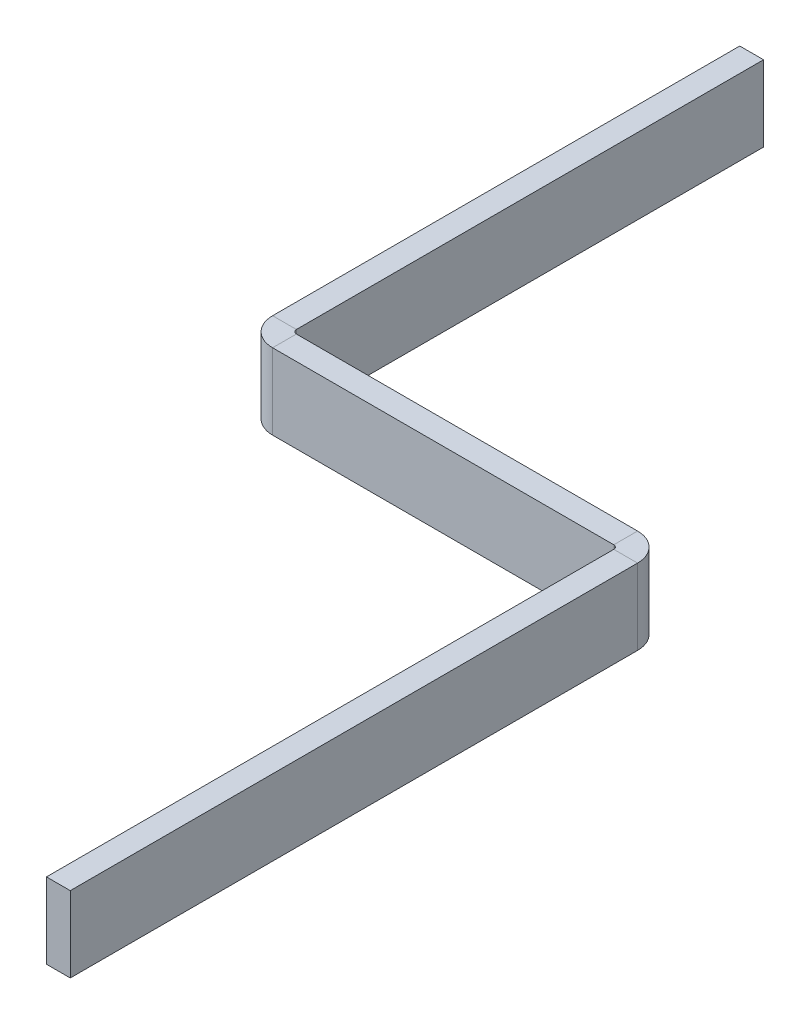
ISO-10303-21;
HEADER;
FILE_DESCRIPTION(('STEP AP214'),'2;1');
FILE_NAME('part.step','',(''),(''),'','','');
FILE_SCHEMA(('AUTOMOTIVE_DESIGN { 1 0 10303 214 1 1 1 1 }'));
ENDSEC;
DATA;
#1=APPLICATION_CONTEXT('core data for automotive mechanical design processes');
#2=APPLICATION_PROTOCOL_DEFINITION('international standard','automotive_design',2000,#1);
#3=PRODUCT_CONTEXT('',#1,'mechanical');
#4=PRODUCT('Part','Part','',(#3));
#5=PRODUCT_RELATED_PRODUCT_CATEGORY('part','',(#4));
#6=PRODUCT_DEFINITION_FORMATION('','',#4);
#7=PRODUCT_DEFINITION_CONTEXT('part definition',#1,'design');
#8=PRODUCT_DEFINITION('design','',#6,#7);
#9=PRODUCT_DEFINITION_SHAPE('','',#8);
#10=(LENGTH_UNIT() NAMED_UNIT(*) SI_UNIT(.MILLI.,.METRE.));
#11=(NAMED_UNIT(*) PLANE_ANGLE_UNIT() SI_UNIT($,.RADIAN.));
#12=(NAMED_UNIT(*) SI_UNIT($,.STERADIAN.) SOLID_ANGLE_UNIT());
#13=UNCERTAINTY_MEASURE_WITH_UNIT(LENGTH_MEASURE(1.E-05),#10,'distance_accuracy_value','');
#14=(GEOMETRIC_REPRESENTATION_CONTEXT(3) GLOBAL_UNCERTAINTY_ASSIGNED_CONTEXT((#13)) GLOBAL_UNIT_ASSIGNED_CONTEXT((#10,
#11,#12)) REPRESENTATION_CONTEXT('',''));
#15=CARTESIAN_POINT('',(0.,0.,0.));
#16=DIRECTION('',(0.,0.,1.));
#17=DIRECTION('',(1.,0.,0.));
#18=AXIS2_PLACEMENT_3D('',#15,#16,#17);
#19=CARTESIAN_POINT('',(94.,-9.53505874833614,62.3751759786992));
#20=DIRECTION('',(0.,1.,0.));
#21=DIRECTION('',(0.,0.,1.));
#22=AXIS2_PLACEMENT_3D('',#19,#20,#21);
#23=PLANE('',#22);
#24=DIRECTION('',(0.,0.,-1.));
#25=VECTOR('',#24,1.);
#26=CARTESIAN_POINT('',(87.,-9.53505874833614,62.3751759786992));
#27=LINE('',#26,#25);
#28=CARTESIAN_POINT('',(87.,-9.53505874833614,62.3751759786992));
#29=VERTEX_POINT('',#28);
#30=CARTESIAN_POINT('',(87.,-9.53505874833614,56.3751759786991));
#31=VERTEX_POINT('',#30);
#32=EDGE_CURVE('E222',#29,#31,#27,.T.);
#33=ORIENTED_EDGE('',*,*,#32,.F.);
#34=DIRECTION('',(1.,0.,0.));
#35=VECTOR('',#34,1.);
#36=CARTESIAN_POINT('',(-2.37356252209926E-13,-9.53505874833614,62.3751759786989));
#37=LINE('',#36,#35);
#38=CARTESIAN_POINT('',(0.999999999999994,-9.53505874833614,62.3751759786989));
#39=VERTEX_POINT('',#38);
#40=EDGE_CURVE('E230',#39,#29,#37,.T.);
#41=ORIENTED_EDGE('',*,*,#40,.F.);
#42=DIRECTION('',(0.,0.,-1.));
#43=VECTOR('',#42,1.);
#44=CARTESIAN_POINT('',(0.999999999999994,-9.53505874833614,56.3751759786988));
#45=LINE('',#44,#43);
#46=CARTESIAN_POINT('',(0.99999999999999,-9.53505874833614,56.3751759786989));
#47=VERTEX_POINT('',#46);
#48=EDGE_CURVE('E240',#47,#39,#45,.F.);
#49=ORIENTED_EDGE('',*,*,#48,.F.);
#50=DIRECTION('',(-1.,0.,0.));
#51=VECTOR('',#50,1.);
#52=CARTESIAN_POINT('',(94.,-9.53505874833614,56.3751759786992));
#53=LINE('',#52,#51);
#54=EDGE_CURVE('E235',#47,#31,#53,.F.);
#55=ORIENTED_EDGE('',*,*,#54,.T.);
#56=EDGE_LOOP('',(#33,#41,#49,#55));
#57=FACE_BOUND('',#56,.T.);
#58=ADVANCED_FACE('F75',(#57),#23,.F.);
#59=CARTESIAN_POINT('',(0.,9.53505874833614,62.3751759786989));
#60=DIRECTION('',(0.,-1.,0.));
#61=DIRECTION('',(0.,0.,-1.));
#62=AXIS2_PLACEMENT_3D('',#59,#60,#61);
#63=PLANE('',#62);
#64=DIRECTION('',(0.,0.,-1.));
#65=VECTOR('',#64,1.);
#66=CARTESIAN_POINT('',(87.,9.53505874833614,62.3751759786992));
#67=LINE('',#66,#65);
#68=CARTESIAN_POINT('',(87.,9.53505874833614,62.3751759786992));
#69=VERTEX_POINT('',#68);
#70=CARTESIAN_POINT('',(87.,9.53505874833614,56.3751759786992));
#71=VERTEX_POINT('',#70);
#72=EDGE_CURVE('E211',#69,#71,#67,.T.);
#73=ORIENTED_EDGE('',*,*,#72,.T.);
#74=DIRECTION('',(1.,0.,0.));
#75=VECTOR('',#74,1.);
#76=CARTESIAN_POINT('',(0.,9.53505874833614,56.3751759786988));
#77=LINE('',#76,#75);
#78=CARTESIAN_POINT('',(0.99999999999999,9.53505874833614,56.3751759786989));
#79=VERTEX_POINT('',#78);
#80=EDGE_CURVE('E233',#71,#79,#77,.F.);
#81=ORIENTED_EDGE('',*,*,#80,.T.);
#82=DIRECTION('',(0.,0.,-1.));
#83=VECTOR('',#82,1.);
#84=CARTESIAN_POINT('',(0.999999999999994,9.53505874833614,62.3751759786989));
#85=LINE('',#84,#83);
#86=CARTESIAN_POINT('',(0.99999999999997,9.53505874833614,62.3751759786989));
#87=VERTEX_POINT('',#86);
#88=EDGE_CURVE('E224',#79,#87,#85,.F.);
#89=ORIENTED_EDGE('',*,*,#88,.T.);
#90=DIRECTION('',(-1.,0.,0.));
#91=VECTOR('',#90,1.);
#92=CARTESIAN_POINT('',(-2.37356252209926E-13,9.53505874833614,62.3751759786989));
#93=LINE('',#92,#91);
#94=EDGE_CURVE('E227',#69,#87,#93,.T.);
#95=ORIENTED_EDGE('',*,*,#94,.F.);
#96=EDGE_LOOP('',(#73,#81,#89,#95));
#97=FACE_BOUND('',#96,.T.);
#98=ADVANCED_FACE('F330',(#97),#63,.F.);
#99=CARTESIAN_POINT('',(-2.37356252209926E-13,0.,62.3751759786989));
#100=DIRECTION('',(0.,0.,-1.));
#101=DIRECTION('',(-1.,0.,0.));
#102=AXIS2_PLACEMENT_3D('',#99,#100,#101);
#103=PLANE('',#102);
#104=DIRECTION('',(0.,1.,0.));
#105=VECTOR('',#104,1.);
#106=CARTESIAN_POINT('',(87.,9.53505874833614,62.3751759786992));
#107=LINE('',#106,#105);
#108=EDGE_CURVE('E217',#69,#29,#107,.F.);
#109=ORIENTED_EDGE('',*,*,#108,.F.);
#110=ORIENTED_EDGE('',*,*,#94,.T.);
#111=DIRECTION('',(0.,-1.,0.));
#112=VECTOR('',#111,1.);
#113=CARTESIAN_POINT('',(0.999999999999994,9.53505874833614,62.3751759786989));
#114=LINE('',#113,#112);
#115=EDGE_CURVE('E238',#39,#87,#114,.F.);
#116=ORIENTED_EDGE('',*,*,#115,.F.);
#117=ORIENTED_EDGE('',*,*,#40,.T.);
#118=EDGE_LOOP('',(#109,#110,#116,#117));
#119=FACE_BOUND('',#118,.T.);
#120=ADVANCED_FACE('F314',(#119),#103,.F.);
#121=CARTESIAN_POINT('',(-2.16407364176867E-13,0.,56.3751759786988));
#122=DIRECTION('',(0.,0.,-1.));
#123=DIRECTION('',(-1.,0.,0.));
#124=AXIS2_PLACEMENT_3D('',#121,#122,#123);
#125=PLANE('',#124);
#126=ORIENTED_EDGE('',*,*,#80,.F.);
#127=DIRECTION('',(0.,1.,0.));
#128=VECTOR('',#127,1.);
#129=CARTESIAN_POINT('',(87.,9.53505874833614,56.3751759786992));
#130=LINE('',#129,#128);
#131=EDGE_CURVE('E206',#71,#31,#130,.F.);
#132=ORIENTED_EDGE('',*,*,#131,.T.);
#133=ORIENTED_EDGE('',*,*,#54,.F.);
#134=DIRECTION('',(0.,-1.,0.));
#135=VECTOR('',#134,1.);
#136=CARTESIAN_POINT('',(0.999999999999994,9.53505874833614,56.3751759786988));
#137=LINE('',#136,#135);
#138=EDGE_CURVE('E243',#79,#47,#137,.T.);
#139=ORIENTED_EDGE('',*,*,#138,.F.);
#140=EDGE_LOOP('',(#126,#132,#133,#139));
#141=FACE_BOUND('',#140,.T.);
#142=ADVANCED_FACE('F322',(#141),#125,.T.);
#143=CARTESIAN_POINT('',(-6.,-9.53505874833614,62.3751759786988));
#144=DIRECTION('',(0.,-1.,0.));
#145=DIRECTION('',(0.,0.,-1.));
#146=AXIS2_PLACEMENT_3D('',#143,#144,#145);
#147=PLANE('',#146);
#148=DIRECTION('',(0.,0.,-1.));
#149=VECTOR('',#148,1.);
#150=CARTESIAN_POINT('',(0.,-9.53505874833614,62.3751759786988));
#151=LINE('',#150,#149);
#152=CARTESIAN_POINT('',(0.,-9.53505874833614,55.3751759786989));
#153=VERTEX_POINT('',#152);
#154=CARTESIAN_POINT('',(0.,-9.53505874833614,-62.3751759786988));
#155=VERTEX_POINT('',#154);
#156=EDGE_CURVE('E271',#153,#155,#151,.T.);
#157=ORIENTED_EDGE('',*,*,#156,.F.);
#158=DIRECTION('',(-1.,0.,0.));
#159=VECTOR('',#158,1.);
#160=CARTESIAN_POINT('',(0.,-9.53505874833614,55.3751759786989));
#161=LINE('',#160,#159);
#162=CARTESIAN_POINT('',(-6.00000000000001,-9.53505874833614,55.3751759786989));
#163=VERTEX_POINT('',#162);
#164=EDGE_CURVE('E252',#153,#163,#161,.T.);
#165=ORIENTED_EDGE('',*,*,#164,.T.);
#166=DIRECTION('',(0.,0.,-1.));
#167=VECTOR('',#166,1.);
#168=CARTESIAN_POINT('',(-6.,-9.53505874833614,62.3751759786988));
#169=LINE('',#168,#167);
#170=CARTESIAN_POINT('',(-6.,-9.53505874833614,-62.3751759786988));
#171=VERTEX_POINT('',#170);
#172=EDGE_CURVE('E274',#163,#171,#169,.T.);
#173=ORIENTED_EDGE('',*,*,#172,.T.);
#174=DIRECTION('',(1.,0.,0.));
#175=VECTOR('',#174,1.);
#176=CARTESIAN_POINT('',(-6.,-9.53505874833614,-62.3751759786988));
#177=LINE('',#176,#175);
#178=EDGE_CURVE('E13',#171,#155,#177,.T.);
#179=ORIENTED_EDGE('',*,*,#178,.T.);
#180=EDGE_LOOP('',(#157,#165,#173,#179));
#181=FACE_BOUND('',#180,.T.);
#182=ADVANCED_FACE('F288',(#181),#147,.T.);
#183=CARTESIAN_POINT('',(-6.,0.,0.));
#184=DIRECTION('',(-1.,0.,0.));
#185=DIRECTION('',(0.,0.,1.));
#186=AXIS2_PLACEMENT_3D('',#183,#184,#185);
#187=PLANE('',#186);
#188=ORIENTED_EDGE('',*,*,#172,.F.);
#189=DIRECTION('',(0.,-1.,0.));
#190=VECTOR('',#189,1.);
#191=CARTESIAN_POINT('',(-6.00000000000001,-9.53505874833614,55.3751759786989));
#192=LINE('',#191,#190);
#193=CARTESIAN_POINT('',(-6.,9.53505874833614,55.3751759786989));
#194=VERTEX_POINT('',#193);
#195=EDGE_CURVE('E247',#163,#194,#192,.F.);
#196=ORIENTED_EDGE('',*,*,#195,.T.);
#197=DIRECTION('',(0.,0.,1.));
#198=VECTOR('',#197,1.);
#199=CARTESIAN_POINT('',(-6.,9.53505874833614,62.3751759786988));
#200=LINE('',#199,#198);
#201=CARTESIAN_POINT('',(-6.,9.53505874833614,-62.3751759786988));
#202=VERTEX_POINT('',#201);
#203=EDGE_CURVE('E270',#202,#194,#200,.T.);
#204=ORIENTED_EDGE('',*,*,#203,.F.);
#205=DIRECTION('',(0.,1.,0.));
#206=VECTOR('',#205,1.);
#207=CARTESIAN_POINT('',(-6.,-9.53505874833614,-62.3751759786988));
#208=LINE('',#207,#206);
#209=EDGE_CURVE('E267',#171,#202,#208,.T.);
#210=ORIENTED_EDGE('',*,*,#209,.F.);
#211=EDGE_LOOP('',(#188,#196,#204,#210));
#212=FACE_BOUND('',#211,.T.);
#213=ADVANCED_FACE('F302',(#212),#187,.T.);
#214=CARTESIAN_POINT('',(0.,0.,0.));
#215=DIRECTION('',(-1.,0.,0.));
#216=DIRECTION('',(0.,0.,1.));
#217=AXIS2_PLACEMENT_3D('',#214,#215,#216);
#218=PLANE('',#217);
#219=DIRECTION('',(0.,-1.,0.));
#220=VECTOR('',#219,1.);
#221=CARTESIAN_POINT('',(0.,-9.53505874833614,55.3751759786989));
#222=LINE('',#221,#220);
#223=CARTESIAN_POINT('',(0.,9.53505874833614,55.3751759786989));
#224=VERTEX_POINT('',#223);
#225=EDGE_CURVE('E258',#153,#224,#222,.F.);
#226=ORIENTED_EDGE('',*,*,#225,.F.);
#227=ORIENTED_EDGE('',*,*,#156,.T.);
#228=DIRECTION('',(0.,1.,0.));
#229=VECTOR('',#228,1.);
#230=CARTESIAN_POINT('',(0.,-9.53505874833614,-62.3751759786988));
#231=LINE('',#230,#229);
#232=CARTESIAN_POINT('',(0.,9.53505874833614,-62.3751759786988));
#233=VERTEX_POINT('',#232);
#234=EDGE_CURVE('E264',#155,#233,#231,.T.);
#235=ORIENTED_EDGE('',*,*,#234,.T.);
#236=DIRECTION('',(0.,0.,1.));
#237=VECTOR('',#236,1.);
#238=CARTESIAN_POINT('',(0.,9.53505874833614,62.3751759786988));
#239=LINE('',#238,#237);
#240=EDGE_CURVE('E278',#233,#224,#239,.T.);
#241=ORIENTED_EDGE('',*,*,#240,.T.);
#242=EDGE_LOOP('',(#226,#227,#235,#241));
#243=FACE_BOUND('',#242,.T.);
#244=ADVANCED_FACE('F284',(#243),#218,.F.);
#245=CARTESIAN_POINT('',(-6.,-9.53505874833614,-62.3751759786988));
#246=DIRECTION('',(0.,0.,-1.));
#247=DIRECTION('',(-1.,0.,0.));
#248=AXIS2_PLACEMENT_3D('',#245,#246,#247);
#249=PLANE('',#248);
#250=ORIENTED_EDGE('',*,*,#234,.F.);
#251=ORIENTED_EDGE('',*,*,#178,.F.);
#252=ORIENTED_EDGE('',*,*,#209,.T.);
#253=DIRECTION('',(1.,0.,0.));
#254=VECTOR('',#253,1.);
#255=CARTESIAN_POINT('',(-6.,9.53505874833614,-62.3751759786988));
#256=LINE('',#255,#254);
#257=EDGE_CURVE('E79',#202,#233,#256,.T.);
#258=ORIENTED_EDGE('',*,*,#257,.T.);
#259=EDGE_LOOP('',(#250,#251,#252,#258));
#260=FACE_BOUND('',#259,.T.);
#261=ADVANCED_FACE('F77',(#260),#249,.T.);
#262=CARTESIAN_POINT('',(-6.,9.53505874833614,62.3751759786988));
#263=DIRECTION('',(0.,1.,0.));
#264=DIRECTION('',(0.,0.,1.));
#265=AXIS2_PLACEMENT_3D('',#262,#263,#264);
#266=PLANE('',#265);
#267=DIRECTION('',(-1.,0.,0.));
#268=VECTOR('',#267,1.);
#269=CARTESIAN_POINT('',(0.,9.53505874833614,55.3751759786989));
#270=LINE('',#269,#268);
#271=EDGE_CURVE('E262',#224,#194,#270,.T.);
#272=ORIENTED_EDGE('',*,*,#271,.F.);
#273=ORIENTED_EDGE('',*,*,#240,.F.);
#274=ORIENTED_EDGE('',*,*,#257,.F.);
#275=ORIENTED_EDGE('',*,*,#203,.T.);
#276=EDGE_LOOP('',(#272,#273,#274,#275));
#277=FACE_BOUND('',#276,.T.);
#278=ADVANCED_FACE('F296',(#277),#266,.T.);
#279=CARTESIAN_POINT('',(0.999999999999994,9.53505874833614,55.3751759786989));
#280=DIRECTION('',(0.,1.,0.));
#281=DIRECTION('',(0.,0.,1.));
#282=AXIS2_PLACEMENT_3D('',#279,#280,#281);
#283=PLANE('',#282);
#284=ORIENTED_EDGE('',*,*,#88,.F.);
#285=CARTESIAN_POINT('',(0.999999999999994,9.53505874833614,55.3751759786989));
#286=DIRECTION('',(0.,-1.,0.));
#287=DIRECTION('',(0.,0.,-1.));
#288=AXIS2_PLACEMENT_3D('',#285,#286,#287);
#289=CIRCLE('',#288,1.);
#290=EDGE_CURVE('E255',#224,#79,#289,.F.);
#291=ORIENTED_EDGE('',*,*,#290,.F.);
#292=ORIENTED_EDGE('',*,*,#271,.T.);
#293=CARTESIAN_POINT('',(0.999999999999994,9.53505874833614,55.3751759786989));
#294=DIRECTION('',(0.,-1.,0.));
#295=DIRECTION('',(0.,0.,-1.));
#296=AXIS2_PLACEMENT_3D('',#293,#294,#295);
#297=CIRCLE('',#296,7.);
#298=EDGE_CURVE('E98',#194,#87,#297,.F.);
#299=ORIENTED_EDGE('',*,*,#298,.T.);
#300=EDGE_LOOP('',(#284,#291,#292,#299));
#301=FACE_BOUND('',#300,.T.);
#302=ADVANCED_FACE('F300',(#301),#283,.T.);
#303=CARTESIAN_POINT('',(0.999999999999994,-9.53505874833614,55.3751759786989));
#304=DIRECTION('',(0.,1.,0.));
#305=DIRECTION('',(0.,0.,1.));
#306=AXIS2_PLACEMENT_3D('',#303,#304,#305);
#307=PLANE('',#306);
#308=CARTESIAN_POINT('',(0.999999999999994,-9.53505874833614,55.3751759786989));
#309=DIRECTION('',(0.,-1.,0.));
#310=DIRECTION('',(0.,0.,-1.));
#311=AXIS2_PLACEMENT_3D('',#308,#309,#310);
#312=CIRCLE('',#311,1.);
#313=EDGE_CURVE('E229',#47,#153,#312,.T.);
#314=ORIENTED_EDGE('',*,*,#313,.F.);
#315=ORIENTED_EDGE('',*,*,#48,.T.);
#316=CARTESIAN_POINT('',(0.999999999999994,-9.53505874833614,55.3751759786989));
#317=DIRECTION('',(0.,-1.,0.));
#318=DIRECTION('',(0.,0.,-1.));
#319=AXIS2_PLACEMENT_3D('',#316,#317,#318);
#320=CIRCLE('',#319,7.);
#321=EDGE_CURVE('E250',#39,#163,#320,.T.);
#322=ORIENTED_EDGE('',*,*,#321,.T.);
#323=ORIENTED_EDGE('',*,*,#164,.F.);
#324=EDGE_LOOP('',(#314,#315,#322,#323));
#325=FACE_BOUND('',#324,.T.);
#326=ADVANCED_FACE('F306',(#325),#307,.F.);
#327=CARTESIAN_POINT('',(0.999999999999994,-9.53505874833614,55.3751759786989));
#328=DIRECTION('',(0.,-1.,0.));
#329=DIRECTION('',(0.,0.,1.));
#330=AXIS2_PLACEMENT_3D('',#327,#328,#329);
#331=CYLINDRICAL_SURFACE('',#330,7.);
#332=ORIENTED_EDGE('',*,*,#195,.F.);
#333=ORIENTED_EDGE('',*,*,#321,.F.);
#334=ORIENTED_EDGE('',*,*,#115,.T.);
#335=ORIENTED_EDGE('',*,*,#298,.F.);
#336=EDGE_LOOP('',(#332,#333,#334,#335));
#337=FACE_BOUND('',#336,.T.);
#338=ADVANCED_FACE('F303',(#337),#331,.T.);
#339=CARTESIAN_POINT('',(0.999999999999994,-9.53505874833614,55.3751759786989));
#340=DIRECTION('',(0.,-1.,0.));
#341=DIRECTION('',(0.,0.,1.));
#342=AXIS2_PLACEMENT_3D('',#339,#340,#341);
#343=CYLINDRICAL_SURFACE('',#342,1.);
#344=ORIENTED_EDGE('',*,*,#225,.T.);
#345=ORIENTED_EDGE('',*,*,#290,.T.);
#346=ORIENTED_EDGE('',*,*,#138,.T.);
#347=ORIENTED_EDGE('',*,*,#313,.T.);
#348=EDGE_LOOP('',(#344,#345,#346,#347));
#349=FACE_BOUND('',#348,.T.);
#350=ADVANCED_FACE('F332',(#349),#343,.F.);
#351=CARTESIAN_POINT('',(87.,-9.53505874833614,63.3751759786992));
#352=DIRECTION('',(0.,-1.,0.));
#353=DIRECTION('',(0.,0.,-1.));
#354=AXIS2_PLACEMENT_3D('',#351,#352,#353);
#355=PLANE('',#354);
#356=DIRECTION('',(-1.,0.,0.));
#357=VECTOR('',#356,1.);
#358=CARTESIAN_POINT('',(94.,-9.53505874833614,63.3751759786992));
#359=LINE('',#358,#357);
#360=CARTESIAN_POINT('',(88.,-9.53505874833614,63.3751759786992));
#361=VERTEX_POINT('',#360);
#362=CARTESIAN_POINT('',(94.,-9.53505874833614,63.3751759786992));
#363=VERTEX_POINT('',#362);
#364=EDGE_CURVE('E189',#361,#363,#359,.F.);
#365=ORIENTED_EDGE('',*,*,#364,.F.);
#366=CARTESIAN_POINT('',(87.,-9.53505874833614,63.3751759786992));
#367=DIRECTION('',(0.,1.,0.));
#368=DIRECTION('',(0.,0.,1.));
#369=AXIS2_PLACEMENT_3D('',#366,#367,#368);
#370=CIRCLE('',#369,1.);
#371=EDGE_CURVE('E214',#29,#361,#370,.F.);
#372=ORIENTED_EDGE('',*,*,#371,.F.);
#373=ORIENTED_EDGE('',*,*,#32,.T.);
#374=CARTESIAN_POINT('',(87.,-9.53505874833614,63.3751759786992));
#375=DIRECTION('',(0.,1.,0.));
#376=DIRECTION('',(0.,0.,1.));
#377=AXIS2_PLACEMENT_3D('',#374,#375,#376);
#378=CIRCLE('',#377,7.);
#379=EDGE_CURVE('E90',#31,#363,#378,.F.);
#380=ORIENTED_EDGE('',*,*,#379,.T.);
#381=EDGE_LOOP('',(#365,#372,#373,#380));
#382=FACE_BOUND('',#381,.T.);
#383=ADVANCED_FACE('F319',(#382),#355,.T.);
#384=CARTESIAN_POINT('',(87.,9.53505874833614,63.3751759786992));
#385=DIRECTION('',(0.,-1.,0.));
#386=DIRECTION('',(0.,0.,-1.));
#387=AXIS2_PLACEMENT_3D('',#384,#385,#386);
#388=PLANE('',#387);
#389=CARTESIAN_POINT('',(87.,9.53505874833614,63.3751759786992));
#390=DIRECTION('',(0.,1.,0.));
#391=DIRECTION('',(0.,0.,1.));
#392=AXIS2_PLACEMENT_3D('',#389,#390,#391);
#393=CIRCLE('',#392,1.);
#394=CARTESIAN_POINT('',(88.,9.53505874833614,63.3751759786992));
#395=VERTEX_POINT('',#394);
#396=EDGE_CURVE('E219',#395,#69,#393,.T.);
#397=ORIENTED_EDGE('',*,*,#396,.F.);
#398=DIRECTION('',(-1.,0.,0.));
#399=VECTOR('',#398,1.);
#400=CARTESIAN_POINT('',(88.,9.53505874833614,63.3751759786992));
#401=LINE('',#400,#399);
#402=CARTESIAN_POINT('',(94.,9.53505874833614,63.3751759786992));
#403=VERTEX_POINT('',#402);
#404=EDGE_CURVE('E200',#395,#403,#401,.F.);
#405=ORIENTED_EDGE('',*,*,#404,.T.);
#406=CARTESIAN_POINT('',(87.,9.53505874833614,63.3751759786992));
#407=DIRECTION('',(0.,1.,0.));
#408=DIRECTION('',(0.,0.,1.));
#409=AXIS2_PLACEMENT_3D('',#406,#407,#408);
#410=CIRCLE('',#409,7.);
#411=EDGE_CURVE('E209',#403,#71,#410,.T.);
#412=ORIENTED_EDGE('',*,*,#411,.T.);
#413=ORIENTED_EDGE('',*,*,#72,.F.);
#414=EDGE_LOOP('',(#397,#405,#412,#413));
#415=FACE_BOUND('',#414,.T.);
#416=ADVANCED_FACE('F327',(#415),#388,.F.);
#417=CARTESIAN_POINT('',(87.,9.53505874833614,63.3751759786992));
#418=DIRECTION('',(0.,1.,0.));
#419=DIRECTION('',(1.,0.,0.));
#420=AXIS2_PLACEMENT_3D('',#417,#418,#419);
#421=CYLINDRICAL_SURFACE('',#420,7.);
#422=ORIENTED_EDGE('',*,*,#131,.F.);
#423=ORIENTED_EDGE('',*,*,#411,.F.);
#424=DIRECTION('',(0.,1.,0.));
#425=VECTOR('',#424,1.);
#426=CARTESIAN_POINT('',(94.,-9.53505874833614,63.3751759786992));
#427=LINE('',#426,#425);
#428=EDGE_CURVE('E198',#403,#363,#427,.F.);
#429=ORIENTED_EDGE('',*,*,#428,.T.);
#430=ORIENTED_EDGE('',*,*,#379,.F.);
#431=EDGE_LOOP('',(#422,#423,#429,#430));
#432=FACE_BOUND('',#431,.T.);
#433=ADVANCED_FACE('F324',(#432),#421,.T.);
#434=CARTESIAN_POINT('',(87.,9.53505874833614,63.3751759786992));
#435=DIRECTION('',(0.,1.,0.));
#436=DIRECTION('',(1.,0.,0.));
#437=AXIS2_PLACEMENT_3D('',#434,#435,#436);
#438=CYLINDRICAL_SURFACE('',#437,1.);
#439=ORIENTED_EDGE('',*,*,#108,.T.);
#440=ORIENTED_EDGE('',*,*,#371,.T.);
#441=DIRECTION('',(0.,1.,0.));
#442=VECTOR('',#441,1.);
#443=CARTESIAN_POINT('',(88.,-9.53505874833614,63.3751759786992));
#444=LINE('',#443,#442);
#445=EDGE_CURVE('E203',#361,#395,#444,.T.);
#446=ORIENTED_EDGE('',*,*,#445,.T.);
#447=ORIENTED_EDGE('',*,*,#396,.T.);
#448=EDGE_LOOP('',(#439,#440,#446,#447));
#449=FACE_BOUND('',#448,.T.);
#450=ADVANCED_FACE('F355',(#449),#438,.F.);
#451=CARTESIAN_POINT('',(94.,-9.53505874833614,62.3751759786992));
#452=DIRECTION('',(0.,1.,0.));
#453=DIRECTION('',(0.,0.,1.));
#454=AXIS2_PLACEMENT_3D('',#451,#452,#453);
#455=PLANE('',#454);
#456=ORIENTED_EDGE('',*,*,#364,.T.);
#457=DIRECTION('',(0.,0.,-1.));
#458=VECTOR('',#457,1.);
#459=CARTESIAN_POINT('',(94.,-9.53505874833614,0.));
#460=LINE('',#459,#458);
#461=CARTESIAN_POINT('',(94.,-9.53505874833614,206.375175978699));
#462=VERTEX_POINT('',#461);
#463=EDGE_CURVE('E170',#462,#363,#460,.T.);
#464=ORIENTED_EDGE('',*,*,#463,.F.);
#465=DIRECTION('',(-1.,0.,0.));
#466=VECTOR('',#465,1.);
#467=CARTESIAN_POINT('',(94.,-9.53505874833614,206.375175978699));
#468=LINE('',#467,#466);
#469=CARTESIAN_POINT('',(88.,-9.53505874833614,206.375175978699));
#470=VERTEX_POINT('',#469);
#471=EDGE_CURVE('E176',#462,#470,#468,.T.);
#472=ORIENTED_EDGE('',*,*,#471,.T.);
#473=DIRECTION('',(0.,0.,1.));
#474=VECTOR('',#473,1.);
#475=CARTESIAN_POINT('',(88.,-9.53505874833614,62.3751759786992));
#476=LINE('',#475,#474);
#477=EDGE_CURVE('E196',#470,#361,#476,.F.);
#478=ORIENTED_EDGE('',*,*,#477,.T.);
#479=EDGE_LOOP('',(#456,#464,#472,#478));
#480=FACE_BOUND('',#479,.T.);
#481=ADVANCED_FACE('F188',(#480),#455,.F.);
#482=CARTESIAN_POINT('',(94.,9.53505874833614,206.375175978699));
#483=DIRECTION('',(0.,-1.,0.));
#484=DIRECTION('',(0.,0.,-1.));
#485=AXIS2_PLACEMENT_3D('',#482,#483,#484);
#486=PLANE('',#485);
#487=ORIENTED_EDGE('',*,*,#404,.F.);
#488=DIRECTION('',(0.,0.,-1.));
#489=VECTOR('',#488,1.);
#490=CARTESIAN_POINT('',(88.,9.53505874833614,206.375175978699));
#491=LINE('',#490,#489);
#492=CARTESIAN_POINT('',(88.,9.53505874833614,206.375175978699));
#493=VERTEX_POINT('',#492);
#494=EDGE_CURVE('E192',#395,#493,#491,.F.);
#495=ORIENTED_EDGE('',*,*,#494,.T.);
#496=DIRECTION('',(-1.,0.,0.));
#497=VECTOR('',#496,1.);
#498=CARTESIAN_POINT('',(94.,9.53505874833614,206.375175978699));
#499=LINE('',#498,#497);
#500=CARTESIAN_POINT('',(94.,9.53505874833614,206.375175978699));
#501=VERTEX_POINT('',#500);
#502=EDGE_CURVE('E185',#501,#493,#499,.T.);
#503=ORIENTED_EDGE('',*,*,#502,.F.);
#504=DIRECTION('',(0.,0.,1.));
#505=VECTOR('',#504,1.);
#506=CARTESIAN_POINT('',(94.,9.53505874833614,0.));
#507=LINE('',#506,#505);
#508=EDGE_CURVE('E172',#403,#501,#507,.T.);
#509=ORIENTED_EDGE('',*,*,#508,.F.);
#510=EDGE_LOOP('',(#487,#495,#503,#509));
#511=FACE_BOUND('',#510,.T.);
#512=ADVANCED_FACE('F363',(#511),#486,.F.);
#513=CARTESIAN_POINT('',(94.,0.,0.));
#514=DIRECTION('',(-1.,0.,0.));
#515=DIRECTION('',(0.,0.,1.));
#516=AXIS2_PLACEMENT_3D('',#513,#514,#515);
#517=PLANE('',#516);
#518=ORIENTED_EDGE('',*,*,#428,.F.);
#519=ORIENTED_EDGE('',*,*,#508,.T.);
#520=DIRECTION('',(0.,-1.,0.));
#521=VECTOR('',#520,1.);
#522=CARTESIAN_POINT('',(94.,0.,206.375175978699));
#523=LINE('',#522,#521);
#524=EDGE_CURVE('E165',#501,#462,#523,.T.);
#525=ORIENTED_EDGE('',*,*,#524,.T.);
#526=ORIENTED_EDGE('',*,*,#463,.T.);
#527=EDGE_LOOP('',(#518,#519,#525,#526));
#528=FACE_BOUND('',#527,.T.);
#529=ADVANCED_FACE('F168',(#528),#517,.F.);
#530=CARTESIAN_POINT('',(88.,0.,0.));
#531=DIRECTION('',(-1.,0.,0.));
#532=DIRECTION('',(0.,0.,1.));
#533=AXIS2_PLACEMENT_3D('',#530,#531,#532);
#534=PLANE('',#533);
#535=ORIENTED_EDGE('',*,*,#494,.F.);
#536=ORIENTED_EDGE('',*,*,#445,.F.);
#537=ORIENTED_EDGE('',*,*,#477,.F.);
#538=DIRECTION('',(0.,1.,0.));
#539=VECTOR('',#538,1.);
#540=CARTESIAN_POINT('',(88.,-9.53505874833614,206.375175978699));
#541=LINE('',#540,#539);
#542=EDGE_CURVE('E181',#493,#470,#541,.F.);
#543=ORIENTED_EDGE('',*,*,#542,.F.);
#544=EDGE_LOOP('',(#535,#536,#537,#543));
#545=FACE_BOUND('',#544,.T.);
#546=ADVANCED_FACE('F369',(#545),#534,.T.);
#547=CARTESIAN_POINT('',(94.,-9.53505874833614,206.375175978699));
#548=DIRECTION('',(0.,0.,-1.));
#549=DIRECTION('',(-1.,0.,0.));
#550=AXIS2_PLACEMENT_3D('',#547,#548,#549);
#551=PLANE('',#550);
#552=ORIENTED_EDGE('',*,*,#542,.T.);
#553=ORIENTED_EDGE('',*,*,#471,.F.);
#554=ORIENTED_EDGE('',*,*,#524,.F.);
#555=ORIENTED_EDGE('',*,*,#502,.T.);
#556=EDGE_LOOP('',(#552,#553,#554,#555));
#557=FACE_BOUND('',#556,.T.);
#558=ADVANCED_FACE('F179',(#557),#551,.F.);
#559=CLOSED_SHELL('',(#58,#98,#120,#142,#182,#213,#244,#261,#278,#302,#326,#338,#350,#383,#416,
#433,#450,#481,#512,#529,#546,#558));
#560=MANIFOLD_SOLID_BREP('B2',#559);
#561=ADVANCED_BREP_SHAPE_REPRESENTATION('',(#18,#560),#14);
#562=SHAPE_DEFINITION_REPRESENTATION(#9,#561);
ENDSEC;
END-ISO-10303-21;
